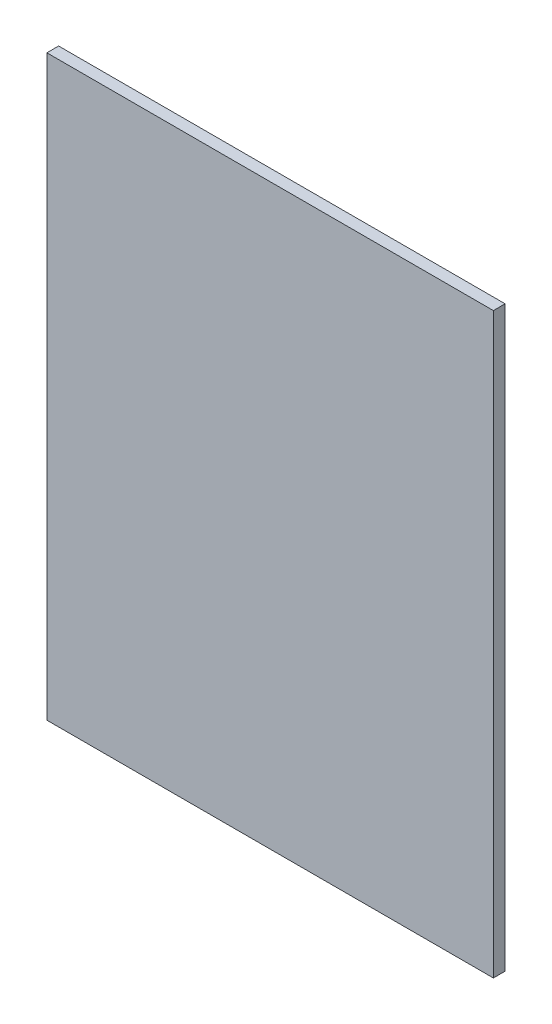
ISO-10303-21;
HEADER;
FILE_DESCRIPTION(('STEP AP214'),'2;1');
FILE_NAME('part.step','',(''),(''),'','','');
FILE_SCHEMA(('AUTOMOTIVE_DESIGN { 1 0 10303 214 1 1 1 1 }'));
ENDSEC;
DATA;
#1=APPLICATION_CONTEXT('core data for automotive mechanical design processes');
#2=APPLICATION_PROTOCOL_DEFINITION('international standard','automotive_design',2000,#1);
#3=PRODUCT_CONTEXT('',#1,'mechanical');
#4=PRODUCT('Part','Part','',(#3));
#5=PRODUCT_RELATED_PRODUCT_CATEGORY('part','',(#4));
#6=PRODUCT_DEFINITION_FORMATION('','',#4);
#7=PRODUCT_DEFINITION_CONTEXT('part definition',#1,'design');
#8=PRODUCT_DEFINITION('design','',#6,#7);
#9=PRODUCT_DEFINITION_SHAPE('','',#8);
#10=(LENGTH_UNIT() NAMED_UNIT(*) SI_UNIT(.MILLI.,.METRE.));
#11=(NAMED_UNIT(*) PLANE_ANGLE_UNIT() SI_UNIT($,.RADIAN.));
#12=(NAMED_UNIT(*) SI_UNIT($,.STERADIAN.) SOLID_ANGLE_UNIT());
#13=UNCERTAINTY_MEASURE_WITH_UNIT(LENGTH_MEASURE(1.E-05),#10,'distance_accuracy_value','');
#14=(GEOMETRIC_REPRESENTATION_CONTEXT(3) GLOBAL_UNCERTAINTY_ASSIGNED_CONTEXT((#13)) GLOBAL_UNIT_ASSIGNED_CONTEXT((#10,
#11,#12)) REPRESENTATION_CONTEXT('',''));
#15=CARTESIAN_POINT('',(0.,0.,0.));
#16=DIRECTION('',(0.,0.,1.));
#17=DIRECTION('',(1.,0.,0.));
#18=AXIS2_PLACEMENT_3D('',#15,#16,#17);
#19=CARTESIAN_POINT('',(31.2344769674775,-77.6925765920143,2.54));
#20=DIRECTION('',(-1.,0.,0.));
#21=DIRECTION('',(0.,0.,1.));
#22=AXIS2_PLACEMENT_3D('',#19,#20,#21);
#23=PLANE('',#22);
#24=DIRECTION('',(0.,1.,0.));
#25=VECTOR('',#24,1.);
#26=CARTESIAN_POINT('',(31.2344769674775,-77.6925765920143,0.));
#27=LINE('',#26,#25);
#28=CARTESIAN_POINT('',(31.2344769674775,-77.6925765920143,0.));
#29=VERTEX_POINT('',#28);
#30=CARTESIAN_POINT('',(31.2344769674775,47.2528782031253,0.));
#31=VERTEX_POINT('',#30);
#32=EDGE_CURVE('E96',#29,#31,#27,.T.);
#33=ORIENTED_EDGE('',*,*,#32,.T.);
#34=DIRECTION('',(0.,0.,-1.));
#35=VECTOR('',#34,1.);
#36=CARTESIAN_POINT('',(31.2344769674775,47.2528782031253,2.54));
#37=LINE('',#36,#35);
#38=CARTESIAN_POINT('',(31.2344769674775,47.2528782031253,2.54));
#39=VERTEX_POINT('',#38);
#40=EDGE_CURVE('E11',#39,#31,#37,.T.);
#41=ORIENTED_EDGE('',*,*,#40,.F.);
#42=DIRECTION('',(0.,1.,0.));
#43=VECTOR('',#42,1.);
#44=CARTESIAN_POINT('',(31.2344769674775,-77.6925765920143,2.54));
#45=LINE('',#44,#43);
#46=CARTESIAN_POINT('',(31.2344769674775,-77.6925765920143,2.54));
#47=VERTEX_POINT('',#46);
#48=EDGE_CURVE('E84',#47,#39,#45,.T.);
#49=ORIENTED_EDGE('',*,*,#48,.F.);
#50=DIRECTION('',(0.,0.,-1.));
#51=VECTOR('',#50,1.);
#52=CARTESIAN_POINT('',(31.2344769674775,-77.6925765920143,2.54));
#53=LINE('',#52,#51);
#54=EDGE_CURVE('E92',#47,#29,#53,.T.);
#55=ORIENTED_EDGE('',*,*,#54,.T.);
#56=EDGE_LOOP('',(#33,#41,#49,#55));
#57=FACE_BOUND('',#56,.T.);
#58=ADVANCED_FACE('F33',(#57),#23,.F.);
#59=CARTESIAN_POINT('',(31.2344769674775,47.2528782031253,2.54));
#60=DIRECTION('',(0.,-1.,0.));
#61=DIRECTION('',(1.,0.,0.));
#62=AXIS2_PLACEMENT_3D('',#59,#60,#61);
#63=PLANE('',#62);
#64=DIRECTION('',(-1.,0.,0.));
#65=VECTOR('',#64,1.);
#66=CARTESIAN_POINT('',(31.2344769674775,47.2528782031253,0.));
#67=LINE('',#66,#65);
#68=CARTESIAN_POINT('',(-65.2855230325225,47.2528782031252,0.));
#69=VERTEX_POINT('',#68);
#70=EDGE_CURVE('E88',#31,#69,#67,.T.);
#71=ORIENTED_EDGE('',*,*,#70,.T.);
#72=DIRECTION('',(0.,0.,-1.));
#73=VECTOR('',#72,1.);
#74=CARTESIAN_POINT('',(-65.2855230325225,47.2528782031252,2.54));
#75=LINE('',#74,#73);
#76=CARTESIAN_POINT('',(-65.2855230325225,47.2528782031252,2.54));
#77=VERTEX_POINT('',#76);
#78=EDGE_CURVE('E41',#77,#69,#75,.T.);
#79=ORIENTED_EDGE('',*,*,#78,.F.);
#80=DIRECTION('',(-1.,0.,0.));
#81=VECTOR('',#80,1.);
#82=CARTESIAN_POINT('',(31.2344769674775,47.2528782031253,2.54));
#83=LINE('',#82,#81);
#84=EDGE_CURVE('E79',#39,#77,#83,.T.);
#85=ORIENTED_EDGE('',*,*,#84,.F.);
#86=ORIENTED_EDGE('',*,*,#40,.T.);
#87=EDGE_LOOP('',(#71,#79,#85,#86));
#88=FACE_BOUND('',#87,.T.);
#89=ADVANCED_FACE('F87',(#88),#63,.F.);
#90=CARTESIAN_POINT('',(-65.2855230325225,47.2528782031252,2.54));
#91=DIRECTION('',(1.,0.,0.));
#92=DIRECTION('',(0.,0.,-1.));
#93=AXIS2_PLACEMENT_3D('',#90,#91,#92);
#94=PLANE('',#93);
#95=DIRECTION('',(0.,-1.,0.));
#96=VECTOR('',#95,1.);
#97=CARTESIAN_POINT('',(-65.2855230325225,47.2528782031252,0.));
#98=LINE('',#97,#96);
#99=CARTESIAN_POINT('',(-65.2855230325225,-77.6925765920143,0.));
#100=VERTEX_POINT('',#99);
#101=EDGE_CURVE('E66',#69,#100,#98,.T.);
#102=ORIENTED_EDGE('',*,*,#101,.T.);
#103=DIRECTION('',(0.,0.,-1.));
#104=VECTOR('',#103,1.);
#105=CARTESIAN_POINT('',(-65.2855230325225,-77.6925765920143,2.54));
#106=LINE('',#105,#104);
#107=CARTESIAN_POINT('',(-65.2855230325225,-77.6925765920143,2.54));
#108=VERTEX_POINT('',#107);
#109=EDGE_CURVE('E89',#108,#100,#106,.T.);
#110=ORIENTED_EDGE('',*,*,#109,.F.);
#111=DIRECTION('',(0.,-1.,0.));
#112=VECTOR('',#111,1.);
#113=CARTESIAN_POINT('',(-65.2855230325225,47.2528782031252,2.54));
#114=LINE('',#113,#112);
#115=EDGE_CURVE('E82',#77,#108,#114,.T.);
#116=ORIENTED_EDGE('',*,*,#115,.F.);
#117=ORIENTED_EDGE('',*,*,#78,.T.);
#118=EDGE_LOOP('',(#102,#110,#116,#117));
#119=FACE_BOUND('',#118,.T.);
#120=ADVANCED_FACE('F90',(#119),#94,.F.);
#121=CARTESIAN_POINT('',(-65.2855230325225,-77.6925765920143,2.54));
#122=DIRECTION('',(0.,1.,0.));
#123=DIRECTION('',(0.,0.,1.));
#124=AXIS2_PLACEMENT_3D('',#121,#122,#123);
#125=PLANE('',#124);
#126=DIRECTION('',(1.,0.,0.));
#127=VECTOR('',#126,1.);
#128=CARTESIAN_POINT('',(-65.2855230325225,-77.6925765920143,0.));
#129=LINE('',#128,#127);
#130=EDGE_CURVE('E72',#100,#29,#129,.T.);
#131=ORIENTED_EDGE('',*,*,#130,.T.);
#132=ORIENTED_EDGE('',*,*,#54,.F.);
#133=DIRECTION('',(1.,0.,0.));
#134=VECTOR('',#133,1.);
#135=CARTESIAN_POINT('',(-65.2855230325225,-77.6925765920143,2.54));
#136=LINE('',#135,#134);
#137=EDGE_CURVE('E49',#108,#47,#136,.T.);
#138=ORIENTED_EDGE('',*,*,#137,.F.);
#139=ORIENTED_EDGE('',*,*,#109,.T.);
#140=EDGE_LOOP('',(#131,#132,#138,#139));
#141=FACE_BOUND('',#140,.T.);
#142=ADVANCED_FACE('F103',(#141),#125,.F.);
#143=CARTESIAN_POINT('',(0.,0.,2.54));
#144=DIRECTION('',(0.,0.,1.));
#145=DIRECTION('',(1.,0.,0.));
#146=AXIS2_PLACEMENT_3D('',#143,#144,#145);
#147=PLANE('',#146);
#148=ORIENTED_EDGE('',*,*,#48,.T.);
#149=ORIENTED_EDGE('',*,*,#84,.T.);
#150=ORIENTED_EDGE('',*,*,#115,.T.);
#151=ORIENTED_EDGE('',*,*,#137,.T.);
#152=EDGE_LOOP('',(#148,#149,#150,#151));
#153=FACE_BOUND('',#152,.T.);
#154=ADVANCED_FACE('F80',(#153),#147,.T.);
#155=CARTESIAN_POINT('',(0.,0.,0.));
#156=DIRECTION('',(0.,0.,1.));
#157=DIRECTION('',(1.,0.,0.));
#158=AXIS2_PLACEMENT_3D('',#155,#156,#157);
#159=PLANE('',#158);
#160=ORIENTED_EDGE('',*,*,#32,.F.);
#161=ORIENTED_EDGE('',*,*,#130,.F.);
#162=ORIENTED_EDGE('',*,*,#101,.F.);
#163=ORIENTED_EDGE('',*,*,#70,.F.);
#164=EDGE_LOOP('',(#160,#161,#162,#163));
#165=FACE_BOUND('',#164,.T.);
#166=ADVANCED_FACE('F106',(#165),#159,.F.);
#167=CLOSED_SHELL('',(#58,#89,#120,#142,#154,#166));
#168=MANIFOLD_SOLID_BREP('B2',#167);
#169=ADVANCED_BREP_SHAPE_REPRESENTATION('',(#18,#168),#14);
#170=SHAPE_DEFINITION_REPRESENTATION(#9,#169);
ENDSEC;
END-ISO-10303-21;
